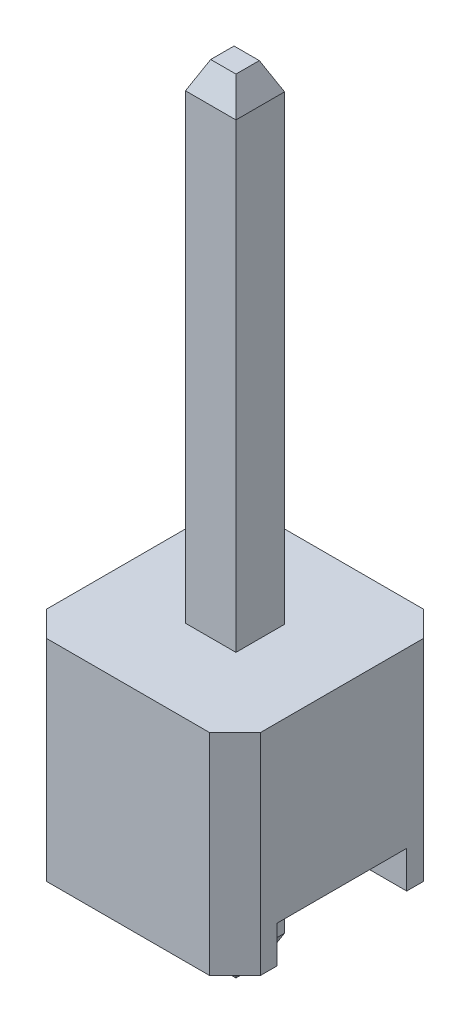
ISO-10303-21;
HEADER;
FILE_DESCRIPTION(('STEP AP214'),'2;1');
FILE_NAME('part.step','',(''),(''),'','','');
FILE_SCHEMA(('AUTOMOTIVE_DESIGN { 1 0 10303 214 1 1 1 1 }'));
ENDSEC;
DATA;
#1=APPLICATION_CONTEXT('core data for automotive mechanical design processes');
#2=APPLICATION_PROTOCOL_DEFINITION('international standard','automotive_design',2000,#1);
#3=PRODUCT_CONTEXT('',#1,'mechanical');
#4=PRODUCT('Part','Part','',(#3));
#5=PRODUCT_RELATED_PRODUCT_CATEGORY('part','',(#4));
#6=PRODUCT_DEFINITION_FORMATION('','',#4);
#7=PRODUCT_DEFINITION_CONTEXT('part definition',#1,'design');
#8=PRODUCT_DEFINITION('design','',#6,#7);
#9=PRODUCT_DEFINITION_SHAPE('','',#8);
#10=(LENGTH_UNIT() NAMED_UNIT(*) SI_UNIT(.MILLI.,.METRE.));
#11=(NAMED_UNIT(*) PLANE_ANGLE_UNIT() SI_UNIT($,.RADIAN.));
#12=(NAMED_UNIT(*) SI_UNIT($,.STERADIAN.) SOLID_ANGLE_UNIT());
#13=UNCERTAINTY_MEASURE_WITH_UNIT(LENGTH_MEASURE(1.E-05),#10,'distance_accuracy_value','');
#14=(GEOMETRIC_REPRESENTATION_CONTEXT(3) GLOBAL_UNCERTAINTY_ASSIGNED_CONTEXT((#13)) GLOBAL_UNIT_ASSIGNED_CONTEXT((#10,
#11,#12)) REPRESENTATION_CONTEXT('',''));
#15=CARTESIAN_POINT('',(0.,0.,0.));
#16=DIRECTION('',(0.,0.,1.));
#17=DIRECTION('',(1.,0.,0.));
#18=AXIS2_PLACEMENT_3D('',#15,#16,#17);
#19=CARTESIAN_POINT('',(13.1274969604626,-5.69124998633488,2.27287404611806));
#20=DIRECTION('',(0.,-1.,0.));
#21=DIRECTION('',(0.,0.,-1.));
#22=AXIS2_PLACEMENT_3D('',#19,#20,#21);
#23=PLANE('',#22);
#24=DIRECTION('',(1.,0.,0.));
#25=VECTOR('',#24,1.);
#26=CARTESIAN_POINT('',(12.5274969604626,-5.69124998633488,2.42287404611806));
#27=LINE('',#26,#25);
#28=CARTESIAN_POINT('',(12.6774969604626,-5.69124998633488,2.42287404611806));
#29=VERTEX_POINT('',#28);
#30=CARTESIAN_POINT('',(12.9774969604626,-5.69124998633488,2.42287404611806));
#31=VERTEX_POINT('',#30);
#32=EDGE_CURVE('E194',#29,#31,#27,.T.);
#33=ORIENTED_EDGE('',*,*,#32,.T.);
#34=DIRECTION('',(0.,0.,1.));
#35=VECTOR('',#34,1.);
#36=CARTESIAN_POINT('',(12.9774969604626,-5.69124998633488,2.27287404611806));
#37=LINE('',#36,#35);
#38=CARTESIAN_POINT('',(12.9774969604626,-5.69124998633488,2.70038017622597));
#39=VERTEX_POINT('',#38);
#40=EDGE_CURVE('E179',#31,#39,#37,.T.);
#41=ORIENTED_EDGE('',*,*,#40,.T.);
#42=DIRECTION('',(1.,0.,0.));
#43=VECTOR('',#42,1.);
#44=CARTESIAN_POINT('',(13.1274969604626,-5.69124998633488,2.70038017622597));
#45=LINE('',#44,#43);
#46=CARTESIAN_POINT('',(12.6774969604626,-5.69124998633488,2.70038017622597));
#47=VERTEX_POINT('',#46);
#48=EDGE_CURVE('E20',#39,#47,#45,.F.);
#49=ORIENTED_EDGE('',*,*,#48,.T.);
#50=DIRECTION('',(0.,0.,1.));
#51=VECTOR('',#50,1.);
#52=CARTESIAN_POINT('',(12.6774969604626,-5.69124998633488,2.85038017622597));
#53=LINE('',#52,#51);
#54=EDGE_CURVE('E174',#47,#29,#53,.F.);
#55=ORIENTED_EDGE('',*,*,#54,.T.);
#56=EDGE_LOOP('',(#33,#41,#49,#55));
#57=FACE_BOUND('',#56,.T.);
#58=ADVANCED_FACE('F17',(#57),#23,.T.);
#59=CARTESIAN_POINT('',(13.1274969604626,-5.36957394825845,2.85038017622597));
#60=DIRECTION('',(0.,0.4226182617407,-0.90630778703665));
#61=DIRECTION('',(0.,0.90630778703665,0.4226182617407));
#62=AXIS2_PLACEMENT_3D('',#59,#60,#61);
#63=PLANE('',#62);
#64=DIRECTION('',(1.,0.,0.));
#65=VECTOR('',#64,1.);
#66=CARTESIAN_POINT('',(13.1274969604626,-5.36957394825845,2.85038017622597));
#67=LINE('',#66,#65);
#68=CARTESIAN_POINT('',(12.5274969604626,-5.36957394825845,2.85038017622597));
#69=VERTEX_POINT('',#68);
#70=CARTESIAN_POINT('',(13.1274969604626,-5.36957394825845,2.85038017622597));
#71=VERTEX_POINT('',#70);
#72=EDGE_CURVE('E186',#69,#71,#67,.T.);
#73=ORIENTED_EDGE('',*,*,#72,.F.);
#74=DIRECTION('',(0.389281620635028,-0.834817129478988,-0.389281620635023));
#75=VECTOR('',#74,1.);
#76=CARTESIAN_POINT('',(12.5274969604626,-5.36957394825845,2.85038017622597));
#77=LINE('',#76,#75);
#78=EDGE_CURVE('E182',#69,#47,#77,.T.);
#79=ORIENTED_EDGE('',*,*,#78,.T.);
#80=ORIENTED_EDGE('',*,*,#48,.F.);
#81=DIRECTION('',(0.389281620635028,0.834817129478988,0.389281620635023));
#82=VECTOR('',#81,1.);
#83=CARTESIAN_POINT('',(12.9774969604626,-5.69124998633488,2.70038017622597));
#84=LINE('',#83,#82);
#85=EDGE_CURVE('E202',#39,#71,#84,.T.);
#86=ORIENTED_EDGE('',*,*,#85,.T.);
#87=EDGE_LOOP('',(#73,#79,#80,#86));
#88=FACE_BOUND('',#87,.T.);
#89=ADVANCED_FACE('F184',(#88),#63,.F.);
#90=CARTESIAN_POINT('',(12.5274969604626,-5.36957394825845,2.85038017622597));
#91=DIRECTION('',(0.906307787036649,0.422618261740701,0.));
#92=DIRECTION('',(-0.422618261740701,0.906307787036649,0.));
#93=AXIS2_PLACEMENT_3D('',#90,#91,#92);
#94=PLANE('',#93);
#95=ORIENTED_EDGE('',*,*,#54,.F.);
#96=ORIENTED_EDGE('',*,*,#78,.F.);
#97=DIRECTION('',(0.,0.,1.));
#98=VECTOR('',#97,1.);
#99=CARTESIAN_POINT('',(12.5274969604626,-5.36957394825845,2.85038017622597));
#100=LINE('',#99,#98);
#101=CARTESIAN_POINT('',(12.5274969604626,-5.36957394825845,2.27287404611806));
#102=VERTEX_POINT('',#101);
#103=EDGE_CURVE('E205',#102,#69,#100,.T.);
#104=ORIENTED_EDGE('',*,*,#103,.F.);
#105=DIRECTION('',(0.389281620635019,-0.834817129478989,0.389281620635027));
#106=VECTOR('',#105,1.);
#107=CARTESIAN_POINT('',(12.5274969604626,-5.36957394825845,2.27287404611806));
#108=LINE('',#107,#106);
#109=EDGE_CURVE('E191',#102,#29,#108,.T.);
#110=ORIENTED_EDGE('',*,*,#109,.T.);
#111=EDGE_LOOP('',(#95,#96,#104,#110));
#112=FACE_BOUND('',#111,.T.);
#113=ADVANCED_FACE('F189',(#112),#94,.F.);
#114=CARTESIAN_POINT('',(12.5274969604626,-5.36957394825845,2.27287404611806));
#115=DIRECTION('',(0.,0.422618261740701,0.906307787036649));
#116=DIRECTION('',(0.,-0.906307787036649,0.422618261740701));
#117=AXIS2_PLACEMENT_3D('',#114,#115,#116);
#118=PLANE('',#117);
#119=ORIENTED_EDGE('',*,*,#32,.F.);
#120=ORIENTED_EDGE('',*,*,#109,.F.);
#121=DIRECTION('',(-1.,0.,0.));
#122=VECTOR('',#121,1.);
#123=CARTESIAN_POINT('',(12.5274969604626,-5.36957394825845,2.27287404611806));
#124=LINE('',#123,#122);
#125=CARTESIAN_POINT('',(13.1274969604626,-5.36957394825845,2.27287404611806));
#126=VERTEX_POINT('',#125);
#127=EDGE_CURVE('E211',#126,#102,#124,.T.);
#128=ORIENTED_EDGE('',*,*,#127,.F.);
#129=DIRECTION('',(-0.389281620635027,-0.834817129478987,0.389281620635025));
#130=VECTOR('',#129,1.);
#131=CARTESIAN_POINT('',(13.1274969604626,-5.36957394825845,2.27287404611806));
#132=LINE('',#131,#130);
#133=EDGE_CURVE('E198',#126,#31,#132,.T.);
#134=ORIENTED_EDGE('',*,*,#133,.T.);
#135=EDGE_LOOP('',(#119,#120,#128,#134));
#136=FACE_BOUND('',#135,.T.);
#137=ADVANCED_FACE('F518',(#136),#118,.F.);
#138=CARTESIAN_POINT('',(13.1274969604626,-5.36957394825845,2.27287404611806));
#139=DIRECTION('',(-0.906307787036649,0.422618261740701,0.));
#140=DIRECTION('',(-0.422618261740701,-0.906307787036649,0.));
#141=AXIS2_PLACEMENT_3D('',#138,#139,#140);
#142=PLANE('',#141);
#143=ORIENTED_EDGE('',*,*,#40,.F.);
#144=ORIENTED_EDGE('',*,*,#133,.F.);
#145=DIRECTION('',(0.,0.,-1.));
#146=VECTOR('',#145,1.);
#147=CARTESIAN_POINT('',(13.1274969604626,-5.36957394825845,2.27287404611806));
#148=LINE('',#147,#146);
#149=EDGE_CURVE('E220',#71,#126,#148,.T.);
#150=ORIENTED_EDGE('',*,*,#149,.F.);
#151=ORIENTED_EDGE('',*,*,#85,.F.);
#152=EDGE_LOOP('',(#143,#144,#150,#151));
#153=FACE_BOUND('',#152,.T.);
#154=ADVANCED_FACE('F514',(#153),#142,.F.);
#155=CARTESIAN_POINT('',(13.1274969604626,-5.69124998633488,2.85038017622597));
#156=DIRECTION('',(0.,0.,1.));
#157=DIRECTION('',(1.,0.,0.));
#158=AXIS2_PLACEMENT_3D('',#155,#156,#157);
#159=PLANE('',#158);
#160=DIRECTION('',(0.,1.,0.));
#161=VECTOR('',#160,1.);
#162=CARTESIAN_POINT('',(13.1274969604626,-5.69124998633488,2.85038017622597));
#163=LINE('',#162,#161);
#164=CARTESIAN_POINT('',(13.1274969604626,-4.25124998633488,2.85038017622597));
#165=VERTEX_POINT('',#164);
#166=EDGE_CURVE('E217',#165,#71,#163,.F.);
#167=ORIENTED_EDGE('',*,*,#166,.F.);
#168=DIRECTION('',(1.,0.,0.));
#169=VECTOR('',#168,1.);
#170=CARTESIAN_POINT('',(11.5574969604626,-4.25124998633488,2.85038017622597));
#171=LINE('',#170,#169);
#172=CARTESIAN_POINT('',(12.5274969604626,-4.25124998633488,2.85038017622597));
#173=VERTEX_POINT('',#172);
#174=EDGE_CURVE('E230',#165,#173,#171,.F.);
#175=ORIENTED_EDGE('',*,*,#174,.T.);
#176=DIRECTION('',(0.,1.,0.));
#177=VECTOR('',#176,1.);
#178=CARTESIAN_POINT('',(12.5274969604626,-5.69124998633488,2.85038017622597));
#179=LINE('',#178,#177);
#180=EDGE_CURVE('E208',#69,#173,#179,.T.);
#181=ORIENTED_EDGE('',*,*,#180,.F.);
#182=ORIENTED_EDGE('',*,*,#72,.T.);
#183=EDGE_LOOP('',(#167,#175,#181,#182));
#184=FACE_BOUND('',#183,.T.);
#185=ADVANCED_FACE('F510',(#184),#159,.T.);
#186=CARTESIAN_POINT('',(12.5274969604626,-5.69124998633488,2.85038017622597));
#187=DIRECTION('',(-1.,0.,0.));
#188=DIRECTION('',(0.,0.,1.));
#189=AXIS2_PLACEMENT_3D('',#186,#187,#188);
#190=PLANE('',#189);
#191=ORIENTED_EDGE('',*,*,#180,.T.);
#192=DIRECTION('',(0.,0.,1.));
#193=VECTOR('',#192,1.);
#194=CARTESIAN_POINT('',(12.5274969604626,-4.25124998633488,3.33162711117202));
#195=LINE('',#194,#193);
#196=CARTESIAN_POINT('',(12.5274969604626,-4.25124998633488,2.27287404611806));
#197=VERTEX_POINT('',#196);
#198=EDGE_CURVE('E232',#173,#197,#195,.F.);
#199=ORIENTED_EDGE('',*,*,#198,.T.);
#200=DIRECTION('',(0.,1.,0.));
#201=VECTOR('',#200,1.);
#202=CARTESIAN_POINT('',(12.5274969604626,-5.69124998633488,2.27287404611806));
#203=LINE('',#202,#201);
#204=EDGE_CURVE('E214',#102,#197,#203,.T.);
#205=ORIENTED_EDGE('',*,*,#204,.F.);
#206=ORIENTED_EDGE('',*,*,#103,.T.);
#207=EDGE_LOOP('',(#191,#199,#205,#206));
#208=FACE_BOUND('',#207,.T.);
#209=ADVANCED_FACE('F506',(#208),#190,.T.);
#210=CARTESIAN_POINT('',(12.5274969604626,-5.69124998633488,2.27287404611806));
#211=DIRECTION('',(0.,0.,-1.));
#212=DIRECTION('',(-1.,0.,0.));
#213=AXIS2_PLACEMENT_3D('',#210,#211,#212);
#214=PLANE('',#213);
#215=ORIENTED_EDGE('',*,*,#204,.T.);
#216=DIRECTION('',(1.,0.,0.));
#217=VECTOR('',#216,1.);
#218=CARTESIAN_POINT('',(11.5574969604626,-4.25124998633488,2.27287404611806));
#219=LINE('',#218,#217);
#220=CARTESIAN_POINT('',(13.1274969604626,-4.25124998633488,2.27287404611806));
#221=VERTEX_POINT('',#220);
#222=EDGE_CURVE('E234',#197,#221,#219,.T.);
#223=ORIENTED_EDGE('',*,*,#222,.T.);
#224=DIRECTION('',(0.,1.,0.));
#225=VECTOR('',#224,1.);
#226=CARTESIAN_POINT('',(13.1274969604626,-5.69124998633488,2.27287404611806));
#227=LINE('',#226,#225);
#228=EDGE_CURVE('E223',#126,#221,#227,.T.);
#229=ORIENTED_EDGE('',*,*,#228,.F.);
#230=ORIENTED_EDGE('',*,*,#127,.T.);
#231=EDGE_LOOP('',(#215,#223,#229,#230));
#232=FACE_BOUND('',#231,.T.);
#233=ADVANCED_FACE('F502',(#232),#214,.T.);
#234=CARTESIAN_POINT('',(13.1274969604626,-5.69124998633488,2.27287404611806));
#235=DIRECTION('',(1.,0.,0.));
#236=DIRECTION('',(0.,0.,-1.));
#237=AXIS2_PLACEMENT_3D('',#234,#235,#236);
#238=PLANE('',#237);
#239=ORIENTED_EDGE('',*,*,#228,.T.);
#240=DIRECTION('',(0.,0.,1.));
#241=VECTOR('',#240,1.);
#242=CARTESIAN_POINT('',(13.1274969604626,-4.25124998633488,3.33162711117202));
#243=LINE('',#242,#241);
#244=EDGE_CURVE('E236',#221,#165,#243,.T.);
#245=ORIENTED_EDGE('',*,*,#244,.T.);
#246=ORIENTED_EDGE('',*,*,#166,.T.);
#247=ORIENTED_EDGE('',*,*,#149,.T.);
#248=EDGE_LOOP('',(#239,#245,#246,#247));
#249=FACE_BOUND('',#248,.T.);
#250=ADVANCED_FACE('F498',(#249),#238,.T.);
#251=CARTESIAN_POINT('',(11.5574969604626,-4.25124998633488,3.33162711117202));
#252=DIRECTION('',(0.,1.,0.));
#253=DIRECTION('',(0.,0.,1.));
#254=AXIS2_PLACEMENT_3D('',#251,#252,#253);
#255=PLANE('',#254);
#256=ORIENTED_EDGE('',*,*,#222,.F.);
#257=ORIENTED_EDGE('',*,*,#198,.F.);
#258=ORIENTED_EDGE('',*,*,#174,.F.);
#259=ORIENTED_EDGE('',*,*,#244,.F.);
#260=EDGE_LOOP('',(#256,#257,#258,#259));
#261=FACE_BOUND('',#260,.T.);
#262=DIRECTION('',(-1.,0.,0.));
#263=VECTOR('',#262,1.);
#264=CARTESIAN_POINT('',(11.5574969604626,-4.25124998633488,1.79162711117202));
#265=LINE('',#264,#263);
#266=CARTESIAN_POINT('',(11.5574969604626,-4.25124998633488,1.79162711117202));
#267=VERTEX_POINT('',#266);
#268=CARTESIAN_POINT('',(14.0974969604626,-4.25124998633488,1.79162711117202));
#269=VERTEX_POINT('',#268);
#270=EDGE_CURVE('E241',#267,#269,#265,.F.);
#271=ORIENTED_EDGE('',*,*,#270,.T.);
#272=DIRECTION('',(0.,0.,1.));
#273=VECTOR('',#272,1.);
#274=CARTESIAN_POINT('',(14.0974969604626,-4.25124998633488,3.33162711117202));
#275=LINE('',#274,#273);
#276=CARTESIAN_POINT('',(14.0974969604626,-4.25124998633488,3.33162711117202));
#277=VERTEX_POINT('',#276);
#278=EDGE_CURVE('E226',#277,#269,#275,.F.);
#279=ORIENTED_EDGE('',*,*,#278,.F.);
#280=DIRECTION('',(1.,0.,0.));
#281=VECTOR('',#280,1.);
#282=CARTESIAN_POINT('',(11.5574969604626,-4.25124998633488,3.33162711117202));
#283=LINE('',#282,#281);
#284=CARTESIAN_POINT('',(11.5574969604626,-4.25124998633488,3.33162711117202));
#285=VERTEX_POINT('',#284);
#286=EDGE_CURVE('E248',#277,#285,#283,.F.);
#287=ORIENTED_EDGE('',*,*,#286,.T.);
#288=DIRECTION('',(0.,0.,1.));
#289=VECTOR('',#288,1.);
#290=CARTESIAN_POINT('',(11.5574969604626,-4.25124998633488,3.33162711117202));
#291=LINE('',#290,#289);
#292=EDGE_CURVE('E228',#267,#285,#291,.T.);
#293=ORIENTED_EDGE('',*,*,#292,.F.);
#294=EDGE_LOOP('',(#271,#279,#287,#293));
#295=FACE_BOUND('',#294,.T.);
#296=ADVANCED_FACE('F495',(#261,#295),#255,.F.);
#297=CARTESIAN_POINT('',(12.9774969604626,3.60875001366512,2.27287404611806));
#298=DIRECTION('',(0.906307787036651,0.422618261740697,0.));
#299=DIRECTION('',(-0.422618261740697,0.906307787036651,0.));
#300=AXIS2_PLACEMENT_3D('',#297,#298,#299);
#301=PLANE('',#300);
#302=DIRECTION('',(0.389281620635025,-0.834817129478989,-0.389281620635022));
#303=VECTOR('',#302,1.);
#304=CARTESIAN_POINT('',(12.9774969604626,3.60875001366512,2.42287404611806));
#305=LINE('',#304,#303);
#306=CARTESIAN_POINT('',(12.9774969604626,3.60875001366512,2.42287404611806));
#307=VERTEX_POINT('',#306);
#308=CARTESIAN_POINT('',(13.1274969604626,3.28707397558869,2.27287404611806));
#309=VERTEX_POINT('',#308);
#310=EDGE_CURVE('E263',#307,#309,#305,.T.);
#311=ORIENTED_EDGE('',*,*,#310,.F.);
#312=DIRECTION('',(0.,0.,-1.));
#313=VECTOR('',#312,1.);
#314=CARTESIAN_POINT('',(12.9774969604626,3.60875001366512,2.27287404611806));
#315=LINE('',#314,#313);
#316=CARTESIAN_POINT('',(12.9774969604626,3.60875001366512,2.70038017622597));
#317=VERTEX_POINT('',#316);
#318=EDGE_CURVE('E256',#307,#317,#315,.F.);
#319=ORIENTED_EDGE('',*,*,#318,.T.);
#320=DIRECTION('',(-0.389281620635025,0.834817129478989,-0.389281620635023));
#321=VECTOR('',#320,1.);
#322=CARTESIAN_POINT('',(13.1274969604626,3.28707397558869,2.85038017622597));
#323=LINE('',#322,#321);
#324=CARTESIAN_POINT('',(13.1274969604626,3.28707397558869,2.85038017622597));
#325=VERTEX_POINT('',#324);
#326=EDGE_CURVE('E253',#325,#317,#323,.T.);
#327=ORIENTED_EDGE('',*,*,#326,.F.);
#328=DIRECTION('',(0.,0.,-1.));
#329=VECTOR('',#328,1.);
#330=CARTESIAN_POINT('',(13.1274969604626,3.28707397558869,2.27287404611806));
#331=LINE('',#330,#329);
#332=EDGE_CURVE('E266',#309,#325,#331,.F.);
#333=ORIENTED_EDGE('',*,*,#332,.F.);
#334=EDGE_LOOP('',(#311,#319,#327,#333));
#335=FACE_BOUND('',#334,.T.);
#336=ADVANCED_FACE('F472',(#335),#301,.T.);
#337=CARTESIAN_POINT('',(11.5574969604626,-4.25124998633488,1.79162711117202));
#338=DIRECTION('',(0.,0.,-1.));
#339=DIRECTION('',(-1.,0.,0.));
#340=AXIS2_PLACEMENT_3D('',#337,#338,#339);
#341=PLANE('',#340);
#342=DIRECTION('',(0.,1.,0.));
#343=VECTOR('',#342,1.);
#344=CARTESIAN_POINT('',(14.0974969604626,-4.25124998633488,1.79162711117202));
#345=LINE('',#344,#343);
#346=CARTESIAN_POINT('',(14.0974969604626,-4.69124998633488,1.79162711117202));
#347=VERTEX_POINT('',#346);
#348=EDGE_CURVE('E244',#269,#347,#345,.F.);
#349=ORIENTED_EDGE('',*,*,#348,.F.);
#350=ORIENTED_EDGE('',*,*,#270,.F.);
#351=DIRECTION('',(0.,1.,0.));
#352=VECTOR('',#351,1.);
#353=CARTESIAN_POINT('',(11.5574969604626,-4.25124998633488,1.79162711117202));
#354=LINE('',#353,#352);
#355=CARTESIAN_POINT('',(11.5574969604626,-4.69124998633488,1.79162711117202));
#356=VERTEX_POINT('',#355);
#357=EDGE_CURVE('E239',#356,#267,#354,.T.);
#358=ORIENTED_EDGE('',*,*,#357,.F.);
#359=DIRECTION('',(1.,0.,0.));
#360=VECTOR('',#359,1.);
#361=CARTESIAN_POINT('',(12.8274969604626,-4.69124998633488,1.79162711117202));
#362=LINE('',#361,#360);
#363=EDGE_CURVE('E273',#356,#347,#362,.T.);
#364=ORIENTED_EDGE('',*,*,#363,.T.);
#365=EDGE_LOOP('',(#349,#350,#358,#364));
#366=FACE_BOUND('',#365,.T.);
#367=ADVANCED_FACE('F488',(#366),#341,.F.);
#368=CARTESIAN_POINT('',(11.5574969604626,-4.25124998633488,3.33162711117202));
#369=DIRECTION('',(0.,0.,1.));
#370=DIRECTION('',(1.,0.,0.));
#371=AXIS2_PLACEMENT_3D('',#368,#369,#370);
#372=PLANE('',#371);
#373=DIRECTION('',(0.,1.,0.));
#374=VECTOR('',#373,1.);
#375=CARTESIAN_POINT('',(11.5574969604626,-4.25124998633488,3.33162711117202));
#376=LINE('',#375,#374);
#377=CARTESIAN_POINT('',(11.5574969604626,-4.69124998633488,3.33162711117202));
#378=VERTEX_POINT('',#377);
#379=EDGE_CURVE('E251',#285,#378,#376,.F.);
#380=ORIENTED_EDGE('',*,*,#379,.F.);
#381=ORIENTED_EDGE('',*,*,#286,.F.);
#382=DIRECTION('',(0.,1.,0.));
#383=VECTOR('',#382,1.);
#384=CARTESIAN_POINT('',(14.0974969604626,-4.25124998633488,3.33162711117202));
#385=LINE('',#384,#383);
#386=CARTESIAN_POINT('',(14.0974969604626,-4.69124998633488,3.33162711117202));
#387=VERTEX_POINT('',#386);
#388=EDGE_CURVE('E246',#387,#277,#385,.T.);
#389=ORIENTED_EDGE('',*,*,#388,.F.);
#390=DIRECTION('',(1.,0.,0.));
#391=VECTOR('',#390,1.);
#392=CARTESIAN_POINT('',(12.8274969604626,-4.69124998633488,3.33162711117202));
#393=LINE('',#392,#391);
#394=EDGE_CURVE('E288',#387,#378,#393,.F.);
#395=ORIENTED_EDGE('',*,*,#394,.T.);
#396=EDGE_LOOP('',(#380,#381,#389,#395));
#397=FACE_BOUND('',#396,.T.);
#398=ADVANCED_FACE('F482',(#397),#372,.F.);
#399=CARTESIAN_POINT('',(13.1274969604626,3.60875001366512,2.70038017622597));
#400=DIRECTION('',(0.,0.422618261740697,0.906307787036651));
#401=DIRECTION('',(0.,-0.906307787036651,0.422618261740697));
#402=AXIS2_PLACEMENT_3D('',#399,#400,#401);
#403=PLANE('',#402);
#404=ORIENTED_EDGE('',*,*,#326,.T.);
#405=DIRECTION('',(1.,0.,0.));
#406=VECTOR('',#405,1.);
#407=CARTESIAN_POINT('',(13.1274969604626,3.60875001366512,2.70038017622597));
#408=LINE('',#407,#406);
#409=CARTESIAN_POINT('',(12.6774969604626,3.60875001366512,2.70038017622597));
#410=VERTEX_POINT('',#409);
#411=EDGE_CURVE('E258',#317,#410,#408,.F.);
#412=ORIENTED_EDGE('',*,*,#411,.T.);
#413=DIRECTION('',(0.389281620635025,0.83481712947899,-0.38928162063502));
#414=VECTOR('',#413,1.);
#415=CARTESIAN_POINT('',(12.5274969604626,3.28707397558869,2.85038017622597));
#416=LINE('',#415,#414);
#417=CARTESIAN_POINT('',(12.5274969604626,3.28707397558869,2.85038017622597));
#418=VERTEX_POINT('',#417);
#419=EDGE_CURVE('E310',#418,#410,#416,.T.);
#420=ORIENTED_EDGE('',*,*,#419,.F.);
#421=DIRECTION('',(1.,0.,0.));
#422=VECTOR('',#421,1.);
#423=CARTESIAN_POINT('',(13.1274969604626,3.28707397558869,2.85038017622597));
#424=LINE('',#423,#422);
#425=EDGE_CURVE('E303',#325,#418,#424,.F.);
#426=ORIENTED_EDGE('',*,*,#425,.F.);
#427=EDGE_LOOP('',(#404,#412,#420,#426));
#428=FACE_BOUND('',#427,.T.);
#429=ADVANCED_FACE('F466',(#428),#403,.T.);
#430=CARTESIAN_POINT('',(13.1274969604626,3.60875001366512,2.27287404611806));
#431=DIRECTION('',(0.,-1.,0.));
#432=DIRECTION('',(0.,0.,-1.));
#433=AXIS2_PLACEMENT_3D('',#430,#431,#432);
#434=PLANE('',#433);
#435=ORIENTED_EDGE('',*,*,#318,.F.);
#436=DIRECTION('',(1.,0.,0.));
#437=VECTOR('',#436,1.);
#438=CARTESIAN_POINT('',(13.1274969604626,3.60875001366512,2.42287404611806));
#439=LINE('',#438,#437);
#440=CARTESIAN_POINT('',(12.6774969604626,3.60875001366512,2.42287404611806));
#441=VERTEX_POINT('',#440);
#442=EDGE_CURVE('E260',#441,#307,#439,.T.);
#443=ORIENTED_EDGE('',*,*,#442,.F.);
#444=DIRECTION('',(0.,0.,1.));
#445=VECTOR('',#444,1.);
#446=CARTESIAN_POINT('',(12.6774969604626,3.60875001366512,2.27287404611806));
#447=LINE('',#446,#445);
#448=EDGE_CURVE('E313',#410,#441,#447,.F.);
#449=ORIENTED_EDGE('',*,*,#448,.F.);
#450=ORIENTED_EDGE('',*,*,#411,.F.);
#451=EDGE_LOOP('',(#435,#443,#449,#450));
#452=FACE_BOUND('',#451,.T.);
#453=ADVANCED_FACE('F474',(#452),#434,.F.);
#454=CARTESIAN_POINT('',(13.1274969604626,3.60875001366512,2.42287404611807));
#455=DIRECTION('',(0.,0.422618261740697,-0.906307787036651));
#456=DIRECTION('',(0.,0.906307787036651,0.422618261740697));
#457=AXIS2_PLACEMENT_3D('',#454,#455,#456);
#458=PLANE('',#457);
#459=ORIENTED_EDGE('',*,*,#310,.T.);
#460=DIRECTION('',(-1.,0.,0.));
#461=VECTOR('',#460,1.);
#462=CARTESIAN_POINT('',(12.5274969604626,3.28707397558869,2.27287404611806));
#463=LINE('',#462,#461);
#464=CARTESIAN_POINT('',(12.5274969604626,3.28707397558869,2.27287404611806));
#465=VERTEX_POINT('',#464);
#466=EDGE_CURVE('E316',#465,#309,#463,.F.);
#467=ORIENTED_EDGE('',*,*,#466,.F.);
#468=DIRECTION('',(-0.389281620635022,-0.83481712947899,-0.389281620635024));
#469=VECTOR('',#468,1.);
#470=CARTESIAN_POINT('',(12.6774969604626,3.60875001366512,2.42287404611806));
#471=LINE('',#470,#469);
#472=EDGE_CURVE('E307',#441,#465,#471,.T.);
#473=ORIENTED_EDGE('',*,*,#472,.F.);
#474=ORIENTED_EDGE('',*,*,#442,.T.);
#475=EDGE_LOOP('',(#459,#467,#473,#474));
#476=FACE_BOUND('',#475,.T.);
#477=ADVANCED_FACE('F471',(#476),#458,.T.);
#478=CARTESIAN_POINT('',(13.1274969604626,-5.69124998633488,2.27287404611806));
#479=DIRECTION('',(1.,0.,0.));
#480=DIRECTION('',(0.,0.,-1.));
#481=AXIS2_PLACEMENT_3D('',#478,#479,#480);
#482=PLANE('',#481);
#483=DIRECTION('',(0.,1.,0.));
#484=VECTOR('',#483,1.);
#485=CARTESIAN_POINT('',(13.1274969604626,-5.69124998633488,2.85038017622597));
#486=LINE('',#485,#484);
#487=CARTESIAN_POINT('',(13.1274969604626,-2.19124998633488,2.85038017622597));
#488=VERTEX_POINT('',#487);
#489=EDGE_CURVE('E300',#488,#325,#486,.T.);
#490=ORIENTED_EDGE('',*,*,#489,.F.);
#491=DIRECTION('',(0.,0.,-1.));
#492=VECTOR('',#491,1.);
#493=CARTESIAN_POINT('',(13.1274969604626,-2.19124998633488,2.27287404611806));
#494=LINE('',#493,#492);
#495=CARTESIAN_POINT('',(13.1274969604626,-2.19124998633488,2.27287404611806));
#496=VERTEX_POINT('',#495);
#497=EDGE_CURVE('E269',#488,#496,#494,.T.);
#498=ORIENTED_EDGE('',*,*,#497,.T.);
#499=DIRECTION('',(0.,1.,0.));
#500=VECTOR('',#499,1.);
#501=CARTESIAN_POINT('',(13.1274969604626,-5.69124998633488,2.27287404611806));
#502=LINE('',#501,#500);
#503=EDGE_CURVE('E319',#309,#496,#502,.F.);
#504=ORIENTED_EDGE('',*,*,#503,.F.);
#505=ORIENTED_EDGE('',*,*,#332,.T.);
#506=EDGE_LOOP('',(#490,#498,#504,#505));
#507=FACE_BOUND('',#506,.T.);
#508=ADVANCED_FACE('F462',(#507),#482,.T.);
#509=CARTESIAN_POINT('',(12.8274969604626,-4.69124998633488,0.321627111172014));
#510=DIRECTION('',(0.,1.,0.));
#511=DIRECTION('',(0.,0.,1.));
#512=AXIS2_PLACEMENT_3D('',#509,#510,#511);
#513=PLANE('',#512);
#514=ORIENTED_EDGE('',*,*,#363,.F.);
#515=DIRECTION('',(0.,0.,1.));
#516=VECTOR('',#515,1.);
#517=CARTESIAN_POINT('',(11.5574969604626,-4.69124998633488,0.321627111172014));
#518=LINE('',#517,#516);
#519=CARTESIAN_POINT('',(11.5574969604626,-4.69124998633488,1.59162711117202));
#520=VERTEX_POINT('',#519);
#521=EDGE_CURVE('E271',#520,#356,#518,.T.);
#522=ORIENTED_EDGE('',*,*,#521,.F.);
#523=DIRECTION('',(0.707106781186547,0.,-0.707106781186548));
#524=VECTOR('',#523,1.);
#525=CARTESIAN_POINT('',(11.8574969604626,-4.69124998633488,1.29162711117202));
#526=LINE('',#525,#524);
#527=CARTESIAN_POINT('',(11.8574969604626,-4.69124998633488,1.29162711117202));
#528=VERTEX_POINT('',#527);
#529=EDGE_CURVE('E280',#520,#528,#526,.T.);
#530=ORIENTED_EDGE('',*,*,#529,.T.);
#531=DIRECTION('',(1.,0.,0.));
#532=VECTOR('',#531,1.);
#533=CARTESIAN_POINT('',(13.7974969604626,-4.69124998633488,1.29162711117202));
#534=LINE('',#533,#532);
#535=CARTESIAN_POINT('',(13.7974969604626,-4.69124998633488,1.29162711117202));
#536=VERTEX_POINT('',#535);
#537=EDGE_CURVE('E330',#528,#536,#534,.T.);
#538=ORIENTED_EDGE('',*,*,#537,.T.);
#539=DIRECTION('',(0.707106781186546,0.,0.707106781186549));
#540=VECTOR('',#539,1.);
#541=CARTESIAN_POINT('',(14.0974969604626,-4.69124998633488,1.59162711117202));
#542=LINE('',#541,#540);
#543=CARTESIAN_POINT('',(14.0974969604626,-4.69124998633488,1.59162711117202));
#544=VERTEX_POINT('',#543);
#545=EDGE_CURVE('E297',#536,#544,#542,.T.);
#546=ORIENTED_EDGE('',*,*,#545,.T.);
#547=DIRECTION('',(0.,0.,1.));
#548=VECTOR('',#547,1.);
#549=CARTESIAN_POINT('',(14.0974969604626,-4.69124998633488,0.321627111172014));
#550=LINE('',#549,#548);
#551=EDGE_CURVE('E276',#347,#544,#550,.F.);
#552=ORIENTED_EDGE('',*,*,#551,.F.);
#553=EDGE_LOOP('',(#514,#522,#530,#538,#546,#552));
#554=FACE_BOUND('',#553,.T.);
#555=ADVANCED_FACE('F630',(#554),#513,.F.);
#556=CARTESIAN_POINT('',(11.8574969604626,-2.19124998633488,1.29162711117202));
#557=DIRECTION('',(0.707106781186548,0.,0.707106781186547));
#558=DIRECTION('',(0.707106781186547,0.,-0.707106781186548));
#559=AXIS2_PLACEMENT_3D('',#556,#557,#558);
#560=PLANE('',#559);
#561=DIRECTION('',(0.,1.,0.));
#562=VECTOR('',#561,1.);
#563=CARTESIAN_POINT('',(11.5574969604626,-2.19124998633488,1.59162711117202));
#564=LINE('',#563,#562);
#565=CARTESIAN_POINT('',(11.5574969604626,-2.19124998633488,1.59162711117202));
#566=VERTEX_POINT('',#565);
#567=EDGE_CURVE('E333',#520,#566,#564,.T.);
#568=ORIENTED_EDGE('',*,*,#567,.T.);
#569=DIRECTION('',(0.707106781186547,0.,-0.707106781186548));
#570=VECTOR('',#569,1.);
#571=CARTESIAN_POINT('',(11.8574969604626,-2.19124998633488,1.29162711117202));
#572=LINE('',#571,#570);
#573=CARTESIAN_POINT('',(11.8574969604626,-2.19124998633488,1.29162711117202));
#574=VERTEX_POINT('',#573);
#575=EDGE_CURVE('E278',#574,#566,#572,.F.);
#576=ORIENTED_EDGE('',*,*,#575,.F.);
#577=DIRECTION('',(0.,1.,0.));
#578=VECTOR('',#577,1.);
#579=CARTESIAN_POINT('',(11.8574969604626,-2.19124998633488,1.29162711117202));
#580=LINE('',#579,#578);
#581=EDGE_CURVE('E327',#574,#528,#580,.F.);
#582=ORIENTED_EDGE('',*,*,#581,.T.);
#583=ORIENTED_EDGE('',*,*,#529,.F.);
#584=EDGE_LOOP('',(#568,#576,#582,#583));
#585=FACE_BOUND('',#584,.T.);
#586=ADVANCED_FACE('F395',(#585),#560,.F.);
#587=CARTESIAN_POINT('',(11.5574969604626,-2.19124998633488,3.53162711117202));
#588=DIRECTION('',(0.707106781186547,0.,-0.707106781186548));
#589=DIRECTION('',(-0.707106781186548,0.,-0.707106781186547));
#590=AXIS2_PLACEMENT_3D('',#587,#588,#589);
#591=PLANE('',#590);
#592=DIRECTION('',(0.,1.,0.));
#593=VECTOR('',#592,1.);
#594=CARTESIAN_POINT('',(11.8574969604626,-2.19124998633488,3.83162711117202));
#595=LINE('',#594,#593);
#596=CARTESIAN_POINT('',(11.8574969604626,-4.69124998633488,3.83162711117202));
#597=VERTEX_POINT('',#596);
#598=CARTESIAN_POINT('',(11.8574969604626,-2.19124998633488,3.83162711117202));
#599=VERTEX_POINT('',#598);
#600=EDGE_CURVE('E341',#597,#599,#595,.T.);
#601=ORIENTED_EDGE('',*,*,#600,.T.);
#602=DIRECTION('',(-0.707106781186548,0.,-0.707106781186547));
#603=VECTOR('',#602,1.);
#604=CARTESIAN_POINT('',(11.5574969604626,-2.19124998633488,3.53162711117202));
#605=LINE('',#604,#603);
#606=CARTESIAN_POINT('',(11.5574969604626,-2.19124998633488,3.53162711117202));
#607=VERTEX_POINT('',#606);
#608=EDGE_CURVE('E282',#607,#599,#605,.F.);
#609=ORIENTED_EDGE('',*,*,#608,.F.);
#610=DIRECTION('',(0.,1.,0.));
#611=VECTOR('',#610,1.);
#612=CARTESIAN_POINT('',(11.5574969604626,-2.19124998633488,3.53162711117202));
#613=LINE('',#612,#611);
#614=CARTESIAN_POINT('',(11.5574969604626,-4.69124998633488,3.53162711117202));
#615=VERTEX_POINT('',#614);
#616=EDGE_CURVE('E336',#607,#615,#613,.F.);
#617=ORIENTED_EDGE('',*,*,#616,.T.);
#618=DIRECTION('',(0.707106781186547,0.,0.707106781186547));
#619=VECTOR('',#618,1.);
#620=CARTESIAN_POINT('',(11.5574969604626,-4.69124998633488,3.53162711117202));
#621=LINE('',#620,#619);
#622=EDGE_CURVE('E284',#615,#597,#621,.T.);
#623=ORIENTED_EDGE('',*,*,#622,.T.);
#624=EDGE_LOOP('',(#601,#609,#617,#623));
#625=FACE_BOUND('',#624,.T.);
#626=ADVANCED_FACE('F402',(#625),#591,.F.);
#627=CARTESIAN_POINT('',(12.8274969604626,-4.69124998633488,0.321627111172014));
#628=DIRECTION('',(0.,1.,0.));
#629=DIRECTION('',(0.,0.,1.));
#630=AXIS2_PLACEMENT_3D('',#627,#628,#629);
#631=PLANE('',#630);
#632=ORIENTED_EDGE('',*,*,#394,.F.);
#633=DIRECTION('',(0.,0.,1.));
#634=VECTOR('',#633,1.);
#635=CARTESIAN_POINT('',(14.0974969604626,-4.69124998633488,0.321627111172014));
#636=LINE('',#635,#634);
#637=CARTESIAN_POINT('',(14.0974969604626,-4.69124998633488,3.53162711117202));
#638=VERTEX_POINT('',#637);
#639=EDGE_CURVE('E286',#638,#387,#636,.F.);
#640=ORIENTED_EDGE('',*,*,#639,.F.);
#641=DIRECTION('',(-0.707106781186549,0.,0.707106781186546));
#642=VECTOR('',#641,1.);
#643=CARTESIAN_POINT('',(13.7974969604626,-4.69124998633488,3.83162711117202));
#644=LINE('',#643,#642);
#645=CARTESIAN_POINT('',(13.7974969604626,-4.69124998633488,3.83162711117202));
#646=VERTEX_POINT('',#645);
#647=EDGE_CURVE('E293',#638,#646,#644,.T.);
#648=ORIENTED_EDGE('',*,*,#647,.T.);
#649=DIRECTION('',(-1.,0.,0.));
#650=VECTOR('',#649,1.);
#651=CARTESIAN_POINT('',(11.8574969604626,-4.69124998633488,3.83162711117202));
#652=LINE('',#651,#650);
#653=EDGE_CURVE('E347',#646,#597,#652,.T.);
#654=ORIENTED_EDGE('',*,*,#653,.T.);
#655=ORIENTED_EDGE('',*,*,#622,.F.);
#656=DIRECTION('',(0.,0.,-1.));
#657=VECTOR('',#656,1.);
#658=CARTESIAN_POINT('',(11.5574969604626,-4.69124998633488,1.59162711117202));
#659=LINE('',#658,#657);
#660=EDGE_CURVE('E338',#615,#378,#659,.T.);
#661=ORIENTED_EDGE('',*,*,#660,.T.);
#662=EDGE_LOOP('',(#632,#640,#648,#654,#655,#661));
#663=FACE_BOUND('',#662,.T.);
#664=ADVANCED_FACE('F405',(#663),#631,.F.);
#665=CARTESIAN_POINT('',(13.7974969604626,-2.19124998633488,3.83162711117202));
#666=DIRECTION('',(-0.707106781186546,0.,-0.707106781186549));
#667=DIRECTION('',(-0.707106781186549,0.,0.707106781186546));
#668=AXIS2_PLACEMENT_3D('',#665,#666,#667);
#669=PLANE('',#668);
#670=DIRECTION('',(0.,1.,0.));
#671=VECTOR('',#670,1.);
#672=CARTESIAN_POINT('',(14.0974969604626,-2.19124998633488,3.53162711117202));
#673=LINE('',#672,#671);
#674=CARTESIAN_POINT('',(14.0974969604626,-2.19124998633488,3.53162711117202));
#675=VERTEX_POINT('',#674);
#676=EDGE_CURVE('E350',#638,#675,#673,.T.);
#677=ORIENTED_EDGE('',*,*,#676,.T.);
#678=DIRECTION('',(-0.707106781186549,0.,0.707106781186546));
#679=VECTOR('',#678,1.);
#680=CARTESIAN_POINT('',(13.7974969604626,-2.19124998633488,3.83162711117202));
#681=LINE('',#680,#679);
#682=CARTESIAN_POINT('',(13.7974969604626,-2.19124998633488,3.83162711117202));
#683=VERTEX_POINT('',#682);
#684=EDGE_CURVE('E291',#683,#675,#681,.F.);
#685=ORIENTED_EDGE('',*,*,#684,.F.);
#686=DIRECTION('',(0.,1.,0.));
#687=VECTOR('',#686,1.);
#688=CARTESIAN_POINT('',(13.7974969604626,-2.19124998633488,3.83162711117202));
#689=LINE('',#688,#687);
#690=EDGE_CURVE('E344',#683,#646,#689,.F.);
#691=ORIENTED_EDGE('',*,*,#690,.T.);
#692=ORIENTED_EDGE('',*,*,#647,.F.);
#693=EDGE_LOOP('',(#677,#685,#691,#692));
#694=FACE_BOUND('',#693,.T.);
#695=ADVANCED_FACE('F414',(#694),#669,.F.);
#696=CARTESIAN_POINT('',(14.0974969604626,-2.19124998633488,1.59162711117202));
#697=DIRECTION('',(-0.707106781186549,0.,0.707106781186546));
#698=DIRECTION('',(0.707106781186546,0.,0.707106781186549));
#699=AXIS2_PLACEMENT_3D('',#696,#697,#698);
#700=PLANE('',#699);
#701=DIRECTION('',(0.,1.,0.));
#702=VECTOR('',#701,1.);
#703=CARTESIAN_POINT('',(13.7974969604626,-2.19124998633488,1.29162711117202));
#704=LINE('',#703,#702);
#705=CARTESIAN_POINT('',(13.7974969604626,-2.19124998633488,1.29162711117202));
#706=VERTEX_POINT('',#705);
#707=EDGE_CURVE('E324',#536,#706,#704,.T.);
#708=ORIENTED_EDGE('',*,*,#707,.T.);
#709=DIRECTION('',(0.707106781186546,0.,0.707106781186549));
#710=VECTOR('',#709,1.);
#711=CARTESIAN_POINT('',(14.0974969604626,-2.19124998633488,1.59162711117202));
#712=LINE('',#711,#710);
#713=CARTESIAN_POINT('',(14.0974969604626,-2.19124998633488,1.59162711117202));
#714=VERTEX_POINT('',#713);
#715=EDGE_CURVE('E295',#714,#706,#712,.F.);
#716=ORIENTED_EDGE('',*,*,#715,.F.);
#717=DIRECTION('',(0.,1.,0.));
#718=VECTOR('',#717,1.);
#719=CARTESIAN_POINT('',(14.0974969604626,-2.19124998633488,1.59162711117202));
#720=LINE('',#719,#718);
#721=EDGE_CURVE('E353',#714,#544,#720,.F.);
#722=ORIENTED_EDGE('',*,*,#721,.T.);
#723=ORIENTED_EDGE('',*,*,#545,.F.);
#724=EDGE_LOOP('',(#708,#716,#722,#723));
#725=FACE_BOUND('',#724,.T.);
#726=ADVANCED_FACE('F384',(#725),#700,.F.);
#727=CARTESIAN_POINT('',(13.1274969604626,-5.69124998633488,2.85038017622597));
#728=DIRECTION('',(0.,0.,1.));
#729=DIRECTION('',(1.,0.,0.));
#730=AXIS2_PLACEMENT_3D('',#727,#728,#729);
#731=PLANE('',#730);
#732=DIRECTION('',(0.,1.,0.));
#733=VECTOR('',#732,1.);
#734=CARTESIAN_POINT('',(12.5274969604626,-5.69124998633488,2.85038017622597));
#735=LINE('',#734,#733);
#736=CARTESIAN_POINT('',(12.5274969604626,-2.19124998633488,2.85038017622597));
#737=VERTEX_POINT('',#736);
#738=EDGE_CURVE('E356',#737,#418,#735,.T.);
#739=ORIENTED_EDGE('',*,*,#738,.F.);
#740=DIRECTION('',(1.,0.,0.));
#741=VECTOR('',#740,1.);
#742=CARTESIAN_POINT('',(13.1274969604626,-2.19124998633488,2.85038017622597));
#743=LINE('',#742,#741);
#744=EDGE_CURVE('E34',#737,#488,#743,.T.);
#745=ORIENTED_EDGE('',*,*,#744,.T.);
#746=ORIENTED_EDGE('',*,*,#489,.T.);
#747=ORIENTED_EDGE('',*,*,#425,.T.);
#748=EDGE_LOOP('',(#739,#745,#746,#747));
#749=FACE_BOUND('',#748,.T.);
#750=ADVANCED_FACE('F422',(#749),#731,.T.);
#751=CARTESIAN_POINT('',(12.6774969604626,3.60875001366512,2.27287404611806));
#752=DIRECTION('',(-0.906307787036651,0.422618261740697,0.));
#753=DIRECTION('',(-0.422618261740697,-0.906307787036651,0.));
#754=AXIS2_PLACEMENT_3D('',#751,#752,#753);
#755=PLANE('',#754);
#756=ORIENTED_EDGE('',*,*,#419,.T.);
#757=ORIENTED_EDGE('',*,*,#448,.T.);
#758=ORIENTED_EDGE('',*,*,#472,.T.);
#759=DIRECTION('',(0.,0.,1.));
#760=VECTOR('',#759,1.);
#761=CARTESIAN_POINT('',(12.5274969604626,3.28707397558869,2.85038017622597));
#762=LINE('',#761,#760);
#763=EDGE_CURVE('E359',#418,#465,#762,.F.);
#764=ORIENTED_EDGE('',*,*,#763,.F.);
#765=EDGE_LOOP('',(#756,#757,#758,#764));
#766=FACE_BOUND('',#765,.T.);
#767=ADVANCED_FACE('F445',(#766),#755,.T.);
#768=CARTESIAN_POINT('',(12.5274969604626,-5.69124998633488,2.27287404611806));
#769=DIRECTION('',(0.,0.,-1.));
#770=DIRECTION('',(-1.,0.,0.));
#771=AXIS2_PLACEMENT_3D('',#768,#769,#770);
#772=PLANE('',#771);
#773=ORIENTED_EDGE('',*,*,#503,.T.);
#774=DIRECTION('',(-1.,0.,0.));
#775=VECTOR('',#774,1.);
#776=CARTESIAN_POINT('',(12.5274969604626,-2.19124998633488,2.27287404611806));
#777=LINE('',#776,#775);
#778=CARTESIAN_POINT('',(12.5274969604626,-2.19124998633488,2.27287404611806));
#779=VERTEX_POINT('',#778);
#780=EDGE_CURVE('E322',#496,#779,#777,.T.);
#781=ORIENTED_EDGE('',*,*,#780,.T.);
#782=DIRECTION('',(0.,1.,0.));
#783=VECTOR('',#782,1.);
#784=CARTESIAN_POINT('',(12.5274969604626,-5.69124998633488,2.27287404611806));
#785=LINE('',#784,#783);
#786=EDGE_CURVE('E362',#465,#779,#785,.F.);
#787=ORIENTED_EDGE('',*,*,#786,.F.);
#788=ORIENTED_EDGE('',*,*,#466,.T.);
#789=EDGE_LOOP('',(#773,#781,#787,#788));
#790=FACE_BOUND('',#789,.T.);
#791=ADVANCED_FACE('F442',(#790),#772,.T.);
#792=CARTESIAN_POINT('',(13.7974969604626,-2.19124998633488,1.29162711117202));
#793=DIRECTION('',(0.,0.,1.));
#794=DIRECTION('',(1.,0.,0.));
#795=AXIS2_PLACEMENT_3D('',#792,#793,#794);
#796=PLANE('',#795);
#797=ORIENTED_EDGE('',*,*,#581,.F.);
#798=DIRECTION('',(1.,0.,0.));
#799=VECTOR('',#798,1.);
#800=CARTESIAN_POINT('',(12.8274969604626,-2.19124998633488,1.29162711117202));
#801=LINE('',#800,#799);
#802=EDGE_CURVE('E365',#706,#574,#801,.F.);
#803=ORIENTED_EDGE('',*,*,#802,.F.);
#804=ORIENTED_EDGE('',*,*,#707,.F.);
#805=ORIENTED_EDGE('',*,*,#537,.F.);
#806=EDGE_LOOP('',(#797,#803,#804,#805));
#807=FACE_BOUND('',#806,.T.);
#808=ADVANCED_FACE('F390',(#807),#796,.F.);
#809=CARTESIAN_POINT('',(11.5574969604626,-2.19124998633488,1.59162711117202));
#810=DIRECTION('',(1.,0.,0.));
#811=DIRECTION('',(0.,0.,-1.));
#812=AXIS2_PLACEMENT_3D('',#809,#810,#811);
#813=PLANE('',#812);
#814=ORIENTED_EDGE('',*,*,#379,.T.);
#815=ORIENTED_EDGE('',*,*,#660,.F.);
#816=ORIENTED_EDGE('',*,*,#616,.F.);
#817=DIRECTION('',(0.,0.,1.));
#818=VECTOR('',#817,1.);
#819=CARTESIAN_POINT('',(11.5574969604626,-2.19124998633488,0.321627111172014));
#820=LINE('',#819,#818);
#821=EDGE_CURVE('E368',#566,#607,#820,.T.);
#822=ORIENTED_EDGE('',*,*,#821,.F.);
#823=ORIENTED_EDGE('',*,*,#567,.F.);
#824=ORIENTED_EDGE('',*,*,#521,.T.);
#825=ORIENTED_EDGE('',*,*,#357,.T.);
#826=ORIENTED_EDGE('',*,*,#292,.T.);
#827=EDGE_LOOP('',(#814,#815,#816,#822,#823,#824,#825,#826));
#828=FACE_BOUND('',#827,.T.);
#829=ADVANCED_FACE('F398',(#828),#813,.F.);
#830=CARTESIAN_POINT('',(11.8574969604626,-2.19124998633488,3.83162711117202));
#831=DIRECTION('',(0.,0.,-1.));
#832=DIRECTION('',(-1.,0.,0.));
#833=AXIS2_PLACEMENT_3D('',#830,#831,#832);
#834=PLANE('',#833);
#835=ORIENTED_EDGE('',*,*,#690,.F.);
#836=DIRECTION('',(1.,0.,0.));
#837=VECTOR('',#836,1.);
#838=CARTESIAN_POINT('',(12.8274969604626,-2.19124998633488,3.83162711117202));
#839=LINE('',#838,#837);
#840=EDGE_CURVE('E371',#599,#683,#839,.T.);
#841=ORIENTED_EDGE('',*,*,#840,.F.);
#842=ORIENTED_EDGE('',*,*,#600,.F.);
#843=ORIENTED_EDGE('',*,*,#653,.F.);
#844=EDGE_LOOP('',(#835,#841,#842,#843));
#845=FACE_BOUND('',#844,.T.);
#846=ADVANCED_FACE('F412',(#845),#834,.F.);
#847=CARTESIAN_POINT('',(14.0974969604626,-2.19124998633488,3.53162711117202));
#848=DIRECTION('',(-1.,0.,0.));
#849=DIRECTION('',(0.,0.,1.));
#850=AXIS2_PLACEMENT_3D('',#847,#848,#849);
#851=PLANE('',#850);
#852=ORIENTED_EDGE('',*,*,#388,.T.);
#853=ORIENTED_EDGE('',*,*,#278,.T.);
#854=ORIENTED_EDGE('',*,*,#348,.T.);
#855=ORIENTED_EDGE('',*,*,#551,.T.);
#856=ORIENTED_EDGE('',*,*,#721,.F.);
#857=DIRECTION('',(0.,0.,1.));
#858=VECTOR('',#857,1.);
#859=CARTESIAN_POINT('',(14.0974969604626,-2.19124998633488,0.321627111172014));
#860=LINE('',#859,#858);
#861=EDGE_CURVE('E26',#675,#714,#860,.F.);
#862=ORIENTED_EDGE('',*,*,#861,.F.);
#863=ORIENTED_EDGE('',*,*,#676,.F.);
#864=ORIENTED_EDGE('',*,*,#639,.T.);
#865=EDGE_LOOP('',(#852,#853,#854,#855,#856,#862,#863,#864));
#866=FACE_BOUND('',#865,.T.);
#867=ADVANCED_FACE('F381',(#866),#851,.F.);
#868=CARTESIAN_POINT('',(12.5274969604626,-5.69124998633488,2.85038017622597));
#869=DIRECTION('',(-1.,0.,0.));
#870=DIRECTION('',(0.,0.,1.));
#871=AXIS2_PLACEMENT_3D('',#868,#869,#870);
#872=PLANE('',#871);
#873=ORIENTED_EDGE('',*,*,#786,.T.);
#874=DIRECTION('',(0.,0.,1.));
#875=VECTOR('',#874,1.);
#876=CARTESIAN_POINT('',(12.5274969604626,-2.19124998633488,0.321627111172014));
#877=LINE('',#876,#875);
#878=EDGE_CURVE('E11',#737,#779,#877,.F.);
#879=ORIENTED_EDGE('',*,*,#878,.F.);
#880=ORIENTED_EDGE('',*,*,#738,.T.);
#881=ORIENTED_EDGE('',*,*,#763,.T.);
#882=EDGE_LOOP('',(#873,#879,#880,#881));
#883=FACE_BOUND('',#882,.T.);
#884=ADVANCED_FACE('F426',(#883),#872,.T.);
#885=CARTESIAN_POINT('',(12.8274969604626,-2.19124998633488,0.321627111172014));
#886=DIRECTION('',(0.,1.,0.));
#887=DIRECTION('',(0.,0.,1.));
#888=AXIS2_PLACEMENT_3D('',#885,#886,#887);
#889=PLANE('',#888);
#890=ORIENTED_EDGE('',*,*,#744,.F.);
#891=ORIENTED_EDGE('',*,*,#878,.T.);
#892=ORIENTED_EDGE('',*,*,#780,.F.);
#893=ORIENTED_EDGE('',*,*,#497,.F.);
#894=EDGE_LOOP('',(#890,#891,#892,#893));
#895=FACE_BOUND('',#894,.T.);
#896=ORIENTED_EDGE('',*,*,#684,.T.);
#897=ORIENTED_EDGE('',*,*,#861,.T.);
#898=ORIENTED_EDGE('',*,*,#715,.T.);
#899=ORIENTED_EDGE('',*,*,#802,.T.);
#900=ORIENTED_EDGE('',*,*,#575,.T.);
#901=ORIENTED_EDGE('',*,*,#821,.T.);
#902=ORIENTED_EDGE('',*,*,#608,.T.);
#903=ORIENTED_EDGE('',*,*,#840,.T.);
#904=EDGE_LOOP('',(#896,#897,#898,#899,#900,#901,#902,#903));
#905=FACE_BOUND('',#904,.T.);
#906=ADVANCED_FACE('F377',(#895,#905),#889,.T.);
#907=CLOSED_SHELL('',(#58,#89,#113,#137,#154,#185,#209,#233,#250,#296,#336,#367,#398,#429,#453,
#477,#508,#555,#586,#626,#664,#695,#726,#750,#767,#791,#808,#829,#846,#867,#884,#906));
#908=MANIFOLD_SOLID_BREP('B1',#907);
#909=ADVANCED_BREP_SHAPE_REPRESENTATION('',(#18,#908),#14);
#910=SHAPE_DEFINITION_REPRESENTATION(#9,#909);
ENDSEC;
END-ISO-10303-21;
